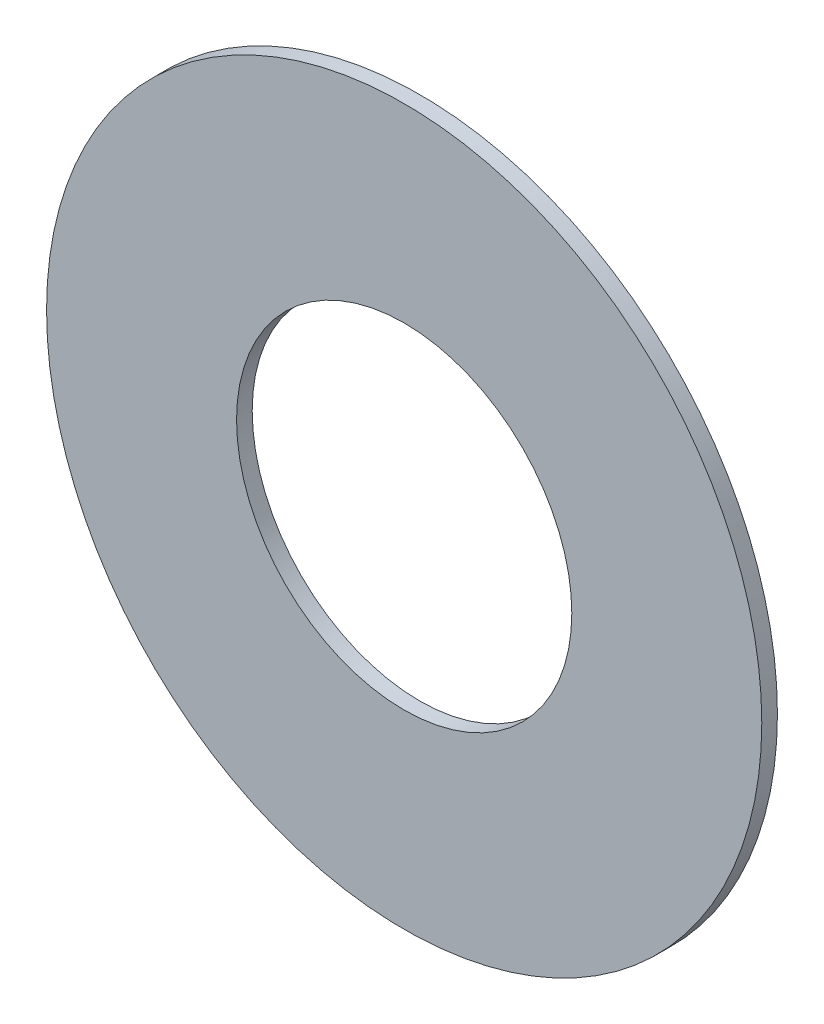
ISO-10303-21;
HEADER;
FILE_DESCRIPTION(('STEP AP214'),'2;1');
FILE_NAME('part.step','',(''),(''),'','','');
FILE_SCHEMA(('AUTOMOTIVE_DESIGN { 1 0 10303 214 1 1 1 1 }'));
ENDSEC;
DATA;
#1=APPLICATION_CONTEXT('core data for automotive mechanical design processes');
#2=APPLICATION_PROTOCOL_DEFINITION('international standard','automotive_design',2000,#1);
#3=PRODUCT_CONTEXT('',#1,'mechanical');
#4=PRODUCT('Part','Part','',(#3));
#5=PRODUCT_RELATED_PRODUCT_CATEGORY('part','',(#4));
#6=PRODUCT_DEFINITION_FORMATION('','',#4);
#7=PRODUCT_DEFINITION_CONTEXT('part definition',#1,'design');
#8=PRODUCT_DEFINITION('design','',#6,#7);
#9=PRODUCT_DEFINITION_SHAPE('','',#8);
#10=(LENGTH_UNIT() NAMED_UNIT(*) SI_UNIT(.MILLI.,.METRE.));
#11=(NAMED_UNIT(*) PLANE_ANGLE_UNIT() SI_UNIT($,.RADIAN.));
#12=(NAMED_UNIT(*) SI_UNIT($,.STERADIAN.) SOLID_ANGLE_UNIT());
#13=UNCERTAINTY_MEASURE_WITH_UNIT(LENGTH_MEASURE(1.E-05),#10,'distance_accuracy_value','');
#14=(GEOMETRIC_REPRESENTATION_CONTEXT(3) GLOBAL_UNCERTAINTY_ASSIGNED_CONTEXT((#13)) GLOBAL_UNIT_ASSIGNED_CONTEXT((#10,
#11,#12)) REPRESENTATION_CONTEXT('',''));
#15=CARTESIAN_POINT('',(0.,0.,0.));
#16=DIRECTION('',(0.,0.,1.));
#17=DIRECTION('',(1.,0.,0.));
#18=AXIS2_PLACEMENT_3D('',#15,#16,#17);
#19=CARTESIAN_POINT('',(166.497,-133.477,-0.045));
#20=DIRECTION('',(0.,0.,-1.));
#21=DIRECTION('',(0.,-1.,0.));
#22=AXIS2_PLACEMENT_3D('',#19,#20,#21);
#23=CYLINDRICAL_SURFACE('',#22,0.375);
#24=CARTESIAN_POINT('',(166.497,-133.477,1.67));
#25=DIRECTION('',(0.,0.,-1.));
#26=DIRECTION('',(0.,-1.,0.));
#27=AXIS2_PLACEMENT_3D('',#24,#25,#26);
#28=CIRCLE('',#27,0.375);
#29=CARTESIAN_POINT('',(166.497,-133.852,1.67));
#30=VERTEX_POINT('',#29);
#31=EDGE_CURVE('E20',#30,#30,#28,.T.);
#32=ORIENTED_EDGE('',*,*,#31,.T.);
#33=DIRECTION('',(0.,0.,1.));
#34=VECTOR('',#33,1.);
#35=CARTESIAN_POINT('',(166.497,-133.852,-0.045));
#36=LINE('',#35,#34);
#37=CARTESIAN_POINT('',(166.497,-133.852,1.705));
#38=VERTEX_POINT('',#37);
#39=EDGE_CURVE('E11',#30,#38,#36,.T.);
#40=ORIENTED_EDGE('',*,*,#39,.T.);
#41=CARTESIAN_POINT('',(166.497,-133.477,1.705));
#42=DIRECTION('',(0.,0.,-1.));
#43=DIRECTION('',(0.,-1.,0.));
#44=AXIS2_PLACEMENT_3D('',#41,#42,#43);
#45=CIRCLE('',#44,0.375);
#46=EDGE_CURVE('E69',#38,#38,#45,.T.);
#47=ORIENTED_EDGE('',*,*,#46,.F.);
#48=ORIENTED_EDGE('',*,*,#39,.F.);
#49=EDGE_LOOP('',(#32,#40,#47,#48));
#50=FACE_BOUND('',#49,.T.);
#51=ADVANCED_FACE('F17',(#50),#23,.F.);
#52=CARTESIAN_POINT('',(166.497,-133.477,1.67));
#53=DIRECTION('',(0.,0.,1.));
#54=DIRECTION('',(1.,0.,0.));
#55=AXIS2_PLACEMENT_3D('',#52,#53,#54);
#56=PLANE('',#55);
#57=ORIENTED_EDGE('',*,*,#31,.F.);
#58=EDGE_LOOP('',(#57));
#59=FACE_BOUND('',#58,.T.);
#60=CARTESIAN_POINT('',(166.497,-133.477,1.67));
#61=DIRECTION('',(0.,0.,1.));
#62=DIRECTION('',(1.,0.,0.));
#63=AXIS2_PLACEMENT_3D('',#60,#61,#62);
#64=CIRCLE('',#63,0.8);
#65=CARTESIAN_POINT('',(167.297,-133.477,1.67));
#66=VERTEX_POINT('',#65);
#67=EDGE_CURVE('E57',#66,#66,#64,.T.);
#68=ORIENTED_EDGE('',*,*,#67,.F.);
#69=EDGE_LOOP('',(#68));
#70=FACE_BOUND('',#69,.T.);
#71=ADVANCED_FACE('F79',(#59,#70),#56,.F.);
#72=CARTESIAN_POINT('',(166.497,-133.477,1.705));
#73=DIRECTION('',(0.,0.,1.));
#74=DIRECTION('',(1.,0.,0.));
#75=AXIS2_PLACEMENT_3D('',#72,#73,#74);
#76=PLANE('',#75);
#77=ORIENTED_EDGE('',*,*,#46,.T.);
#78=EDGE_LOOP('',(#77));
#79=FACE_BOUND('',#78,.T.);
#80=CARTESIAN_POINT('',(166.497,-133.477,1.705));
#81=DIRECTION('',(0.,0.,1.));
#82=DIRECTION('',(1.,0.,0.));
#83=AXIS2_PLACEMENT_3D('',#80,#81,#82);
#84=CIRCLE('',#83,0.8);
#85=CARTESIAN_POINT('',(167.297,-133.477,1.705));
#86=VERTEX_POINT('',#85);
#87=EDGE_CURVE('E55',#86,#86,#84,.T.);
#88=ORIENTED_EDGE('',*,*,#87,.T.);
#89=EDGE_LOOP('',(#88));
#90=FACE_BOUND('',#89,.T.);
#91=ADVANCED_FACE('F61',(#79,#90),#76,.T.);
#92=CARTESIAN_POINT('',(166.497,-133.477,1.67));
#93=DIRECTION('',(0.,0.,1.));
#94=DIRECTION('',(1.,0.,0.));
#95=AXIS2_PLACEMENT_3D('',#92,#93,#94);
#96=CYLINDRICAL_SURFACE('',#95,0.8);
#97=ORIENTED_EDGE('',*,*,#87,.F.);
#98=DIRECTION('',(0.,0.,1.));
#99=VECTOR('',#98,1.);
#100=CARTESIAN_POINT('',(167.297,-133.477,1.67));
#101=LINE('',#100,#99);
#102=EDGE_CURVE('E52',#66,#86,#101,.T.);
#103=ORIENTED_EDGE('',*,*,#102,.F.);
#104=ORIENTED_EDGE('',*,*,#67,.T.);
#105=ORIENTED_EDGE('',*,*,#102,.T.);
#106=EDGE_LOOP('',(#97,#103,#104,#105));
#107=FACE_BOUND('',#106,.T.);
#108=ADVANCED_FACE('F54',(#107),#96,.T.);
#109=CLOSED_SHELL('',(#51,#71,#91,#108));
#110=MANIFOLD_SOLID_BREP('B1',#109);
#111=ADVANCED_BREP_SHAPE_REPRESENTATION('',(#18,#110),#14);
#112=SHAPE_DEFINITION_REPRESENTATION(#9,#111);
ENDSEC;
END-ISO-10303-21;
